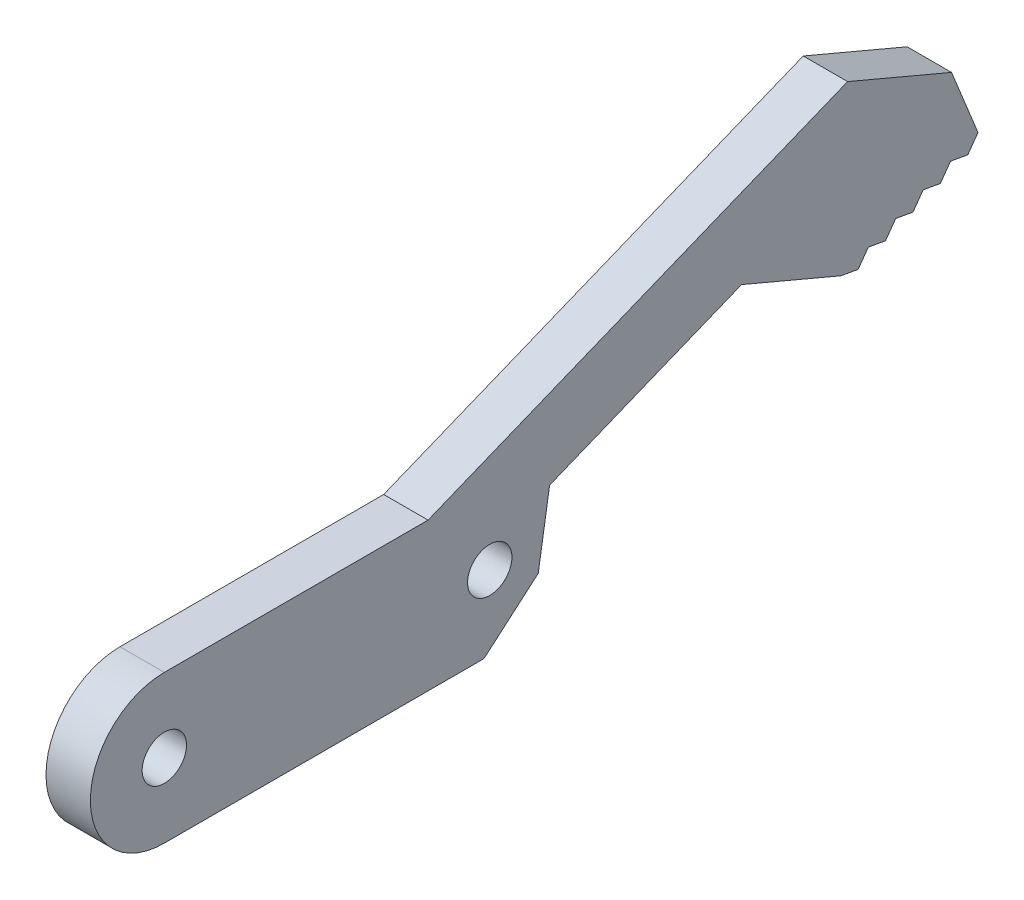
ISO-10303-21;
HEADER;
FILE_DESCRIPTION(('STEP AP214'),'2;1');
FILE_NAME('part.step','',(''),(''),'','','');
FILE_SCHEMA(('AUTOMOTIVE_DESIGN { 1 0 10303 214 1 1 1 1 }'));
ENDSEC;
DATA;
#1=APPLICATION_CONTEXT('core data for automotive mechanical design processes');
#2=APPLICATION_PROTOCOL_DEFINITION('international standard','automotive_design',2000,#1);
#3=PRODUCT_CONTEXT('',#1,'mechanical');
#4=PRODUCT('Part','Part','',(#3));
#5=PRODUCT_RELATED_PRODUCT_CATEGORY('part','',(#4));
#6=PRODUCT_DEFINITION_FORMATION('','',#4);
#7=PRODUCT_DEFINITION_CONTEXT('part definition',#1,'design');
#8=PRODUCT_DEFINITION('design','',#6,#7);
#9=PRODUCT_DEFINITION_SHAPE('','',#8);
#10=(LENGTH_UNIT() NAMED_UNIT(*) SI_UNIT(.MILLI.,.METRE.));
#11=(NAMED_UNIT(*) PLANE_ANGLE_UNIT() SI_UNIT($,.RADIAN.));
#12=(NAMED_UNIT(*) SI_UNIT($,.STERADIAN.) SOLID_ANGLE_UNIT());
#13=UNCERTAINTY_MEASURE_WITH_UNIT(LENGTH_MEASURE(1.E-05),#10,'distance_accuracy_value','');
#14=(GEOMETRIC_REPRESENTATION_CONTEXT(3) GLOBAL_UNCERTAINTY_ASSIGNED_CONTEXT((#13)) GLOBAL_UNIT_ASSIGNED_CONTEXT((#10,
#11,#12)) REPRESENTATION_CONTEXT('',''));
#15=CARTESIAN_POINT('',(0.,0.,0.));
#16=DIRECTION('',(0.,0.,1.));
#17=DIRECTION('',(1.,0.,0.));
#18=AXIS2_PLACEMENT_3D('',#15,#16,#17);
#19=CARTESIAN_POINT('',(1.5,0.,0.));
#20=DIRECTION('',(1.,0.,0.));
#21=DIRECTION('',(0.,0.,-1.));
#22=AXIS2_PLACEMENT_3D('',#19,#20,#21);
#23=PLANE('',#22);
#24=CARTESIAN_POINT('',(1.5,0.,-11.));
#25=DIRECTION('',(1.,0.,0.));
#26=DIRECTION('',(0.,0.,-1.));
#27=AXIS2_PLACEMENT_3D('',#24,#25,#26);
#28=CIRCLE('',#27,1.5);
#29=CARTESIAN_POINT('',(1.5,0.,-12.5));
#30=VERTEX_POINT('',#29);
#31=EDGE_CURVE('E134',#30,#30,#28,.T.);
#32=ORIENTED_EDGE('',*,*,#31,.F.);
#33=EDGE_LOOP('',(#32));
#34=FACE_BOUND('',#33,.T.);
#35=CARTESIAN_POINT('',(1.5,0.,11.));
#36=DIRECTION('',(1.,0.,0.));
#37=DIRECTION('',(0.,0.,-1.));
#38=AXIS2_PLACEMENT_3D('',#35,#36,#37);
#39=CIRCLE('',#38,1.5);
#40=CARTESIAN_POINT('',(1.5,0.,9.50000000000001));
#41=VERTEX_POINT('',#40);
#42=EDGE_CURVE('E105',#41,#41,#39,.T.);
#43=ORIENTED_EDGE('',*,*,#42,.F.);
#44=EDGE_LOOP('',(#43));
#45=FACE_BOUND('',#44,.T.);
#46=DIRECTION('',(0.,0.811746559900306,-0.584009865062243));
#47=VECTOR('',#46,1.);
#48=CARTESIAN_POINT('',(1.5,-17.1372740545539,-23.8200141676892));
#49=LINE('',#48,#47);
#50=CARTESIAN_POINT('',(1.5,7.39191676895877,-41.4675043211245));
#51=VERTEX_POINT('',#50);
#52=CARTESIAN_POINT('',(1.5,8.35132428291398,-42.1577486417576));
#53=VERTEX_POINT('',#52);
#54=EDGE_CURVE('E292',#51,#53,#49,.T.);
#55=ORIENTED_EDGE('',*,*,#54,.T.);
#56=DIRECTION('',(0.,-0.176310458660285,-0.984334608843456));
#57=VECTOR('',#56,1.);
#58=CARTESIAN_POINT('',(1.5,15.4081336773122,-2.7598492335221));
#59=LINE('',#58,#57);
#60=CARTESIAN_POINT('',(1.5,8.14294202768355,-43.3211388753874));
#61=VERTEX_POINT('',#60);
#62=EDGE_CURVE('E296',#53,#61,#59,.T.);
#63=ORIENTED_EDGE('',*,*,#62,.T.);
#64=DIRECTION('',(0.,0.811746559900309,-0.584009865062239));
#65=VECTOR('',#64,1.);
#66=CARTESIAN_POINT('',(1.5,-17.7598725540869,-24.6853971353918));
#67=LINE('',#66,#65);
#68=CARTESIAN_POINT('',(1.5,9.10234954163876,-44.0113831960205));
#69=VERTEX_POINT('',#68);
#70=EDGE_CURVE('E245',#61,#69,#67,.T.);
#71=ORIENTED_EDGE('',*,*,#70,.T.);
#72=DIRECTION('',(0.,0.926817277131445,0.375512629362388));
#73=VECTOR('',#72,1.);
#74=CARTESIAN_POINT('',(1.5,16.6008716845223,-40.9732549309526));
#75=LINE('',#74,#73);
#76=CARTESIAN_POINT('',(1.5,13.5184546570459,-42.2221381265287));
#77=VERTEX_POINT('',#76);
#78=EDGE_CURVE('E68',#69,#77,#75,.T.);
#79=ORIENTED_EDGE('',*,*,#78,.T.);
#80=DIRECTION('',(0.,-0.389831254937157,-0.920886308223834));
#81=VECTOR('',#80,1.);
#82=CARTESIAN_POINT('',(1.5,16.4926366310558,-35.1963201005385));
#83=LINE('',#82,#81);
#84=CARTESIAN_POINT('',(1.5,16.4926366310558,-35.1963201005385));
#85=VERTEX_POINT('',#84);
#86=EDGE_CURVE('E196',#85,#77,#83,.T.);
#87=ORIENTED_EDGE('',*,*,#86,.F.);
#88=DIRECTION('',(0.,0.375512629362387,-0.926817277131445));
#89=VECTOR('',#88,1.);
#90=CARTESIAN_POINT('',(1.5,1.91758297252369,0.776934830414033));
#91=LINE('',#90,#89);
#92=CARTESIAN_POINT('',(1.5,5.,-6.83089812380655));
#93=VERTEX_POINT('',#92);
#94=EDGE_CURVE('E179',#93,#85,#91,.T.);
#95=ORIENTED_EDGE('',*,*,#94,.F.);
#96=DIRECTION('',(0.,0.,-1.));
#97=VECTOR('',#96,1.);
#98=CARTESIAN_POINT('',(1.5,4.99999999999999,0.));
#99=LINE('',#98,#97);
#100=CARTESIAN_POINT('',(1.5,5.,11.));
#101=VERTEX_POINT('',#100);
#102=EDGE_CURVE('E120',#101,#93,#99,.T.);
#103=ORIENTED_EDGE('',*,*,#102,.F.);
#104=CARTESIAN_POINT('',(1.5,0.,11.));
#105=DIRECTION('',(1.,0.,0.));
#106=DIRECTION('',(0.,0.,-1.));
#107=AXIS2_PLACEMENT_3D('',#104,#105,#106);
#108=CIRCLE('',#107,5.);
#109=CARTESIAN_POINT('',(1.5,-5.,11.));
#110=VERTEX_POINT('',#109);
#111=EDGE_CURVE('E76',#101,#110,#108,.T.);
#112=ORIENTED_EDGE('',*,*,#111,.T.);
#113=DIRECTION('',(0.,0.,-1.));
#114=VECTOR('',#113,1.);
#115=CARTESIAN_POINT('',(1.5,-5.,0.));
#116=LINE('',#115,#114);
#117=CARTESIAN_POINT('',(1.5,-5.,-10.6103174919287));
#118=VERTEX_POINT('',#117);
#119=EDGE_CURVE('E104',#110,#118,#116,.T.);
#120=ORIENTED_EDGE('',*,*,#119,.T.);
#121=DIRECTION('',(0.,-0.652055247286905,0.758171454544164));
#122=VECTOR('',#121,1.);
#123=CARTESIAN_POINT('',(1.5,-8.11953898551642,-6.9831012092637));
#124=LINE('',#123,#122);
#125=CARTESIAN_POINT('',(1.5,-1.84405260313138,-14.2798673319224));
#126=VERTEX_POINT('',#125);
#127=EDGE_CURVE('E246',#126,#118,#124,.T.);
#128=ORIENTED_EDGE('',*,*,#127,.F.);
#129=DIRECTION('',(0.,-0.987317731643147,0.158756722008964));
#130=VECTOR('',#129,1.);
#131=CARTESIAN_POINT('',(1.5,-2.2847508524873,-14.209004825132));
#132=LINE('',#131,#130);
#133=CARTESIAN_POINT('',(1.5,2.93456521802145,-15.0482498664458));
#134=VERTEX_POINT('',#133);
#135=EDGE_CURVE('E250',#134,#126,#132,.T.);
#136=ORIENTED_EDGE('',*,*,#135,.F.);
#137=DIRECTION('',(0.,0.375512629362387,-0.926817277131445));
#138=VECTOR('',#137,1.);
#139=CARTESIAN_POINT('',(1.5,-2.71650341313353,-1.1006283163979));
#140=LINE('',#139,#138);
#141=CARTESIAN_POINT('',(1.5,8.19174202909487,-28.0236917462861));
#142=VERTEX_POINT('',#141);
#143=EDGE_CURVE('E154',#134,#142,#140,.T.);
#144=ORIENTED_EDGE('',*,*,#143,.T.);
#145=DIRECTION('',(0.,0.389831254937157,0.920886308223834));
#146=VECTOR('',#145,1.);
#147=CARTESIAN_POINT('',(1.5,17.0070885712925,-7.19947144546191));
#148=LINE('',#147,#146);
#149=CARTESIAN_POINT('',(1.5,5.34722324801487,-34.743210424706));
#150=VERTEX_POINT('',#149);
#151=EDGE_CURVE('E176',#150,#142,#148,.T.);
#152=ORIENTED_EDGE('',*,*,#151,.F.);
#153=DIRECTION('',(0.,-0.176310458660285,-0.984334608843456));
#154=VECTOR('',#153,1.);
#155=CARTESIAN_POINT('',(1.5,11.2106343735009,-2.00800832410744));
#156=LINE('',#155,#154);
#157=CARTESIAN_POINT('',(1.5,5.13884099278445,-35.9066006583358));
#158=VERTEX_POINT('',#157);
#159=EDGE_CURVE('E269',#150,#158,#156,.T.);
#160=ORIENTED_EDGE('',*,*,#159,.T.);
#161=DIRECTION('',(0.,0.811746559900309,-0.584009865062239));
#162=VECTOR('',#161,1.);
#163=CARTESIAN_POINT('',(1.5,-15.2694785559546,-21.223865264582));
#164=LINE('',#163,#162);
#165=CARTESIAN_POINT('',(1.5,6.09824850673965,-36.5968449789689));
#166=VERTEX_POINT('',#165);
#167=EDGE_CURVE('E230',#158,#166,#164,.T.);
#168=ORIENTED_EDGE('',*,*,#167,.T.);
#169=DIRECTION('',(0.,-0.176310458660285,-0.984334608843456));
#170=VECTOR('',#169,1.);
#171=CARTESIAN_POINT('',(1.5,12.2600091994537,-2.1959685514611));
#172=LINE('',#171,#170);
#173=CARTESIAN_POINT('',(1.5,5.88986625150922,-37.7602352125987));
#174=VERTEX_POINT('',#173);
#175=EDGE_CURVE('E208',#166,#174,#172,.T.);
#176=ORIENTED_EDGE('',*,*,#175,.T.);
#177=DIRECTION('',(0.,0.811746559900306,-0.584009865062243));
#178=VECTOR('',#177,1.);
#179=CARTESIAN_POINT('',(1.5,-15.8920770554877,-22.0892482322843));
#180=LINE('',#179,#178);
#181=CARTESIAN_POINT('',(1.5,6.84927376546443,-38.4504795332318));
#182=VERTEX_POINT('',#181);
#183=EDGE_CURVE('E270',#174,#182,#180,.T.);
#184=ORIENTED_EDGE('',*,*,#183,.T.);
#185=DIRECTION('',(0.,-0.176310458660286,-0.984334608843456));
#186=VECTOR('',#185,1.);
#187=CARTESIAN_POINT('',(1.5,13.3093840254066,-2.38392877881479));
#188=LINE('',#187,#186);
#189=CARTESIAN_POINT('',(1.5,6.640891510234,-39.6138697668616));
#190=VERTEX_POINT('',#189);
#191=EDGE_CURVE('E274',#182,#190,#188,.T.);
#192=ORIENTED_EDGE('',*,*,#191,.T.);
#193=DIRECTION('',(0.,0.811746559900306,-0.584009865062243));
#194=VECTOR('',#193,1.);
#195=CARTESIAN_POINT('',(1.5,-16.5146755550208,-22.9546311999867));
#196=LINE('',#195,#194);
#197=CARTESIAN_POINT('',(1.5,7.6002990241892,-40.3041140874947));
#198=VERTEX_POINT('',#197);
#199=EDGE_CURVE('E209',#190,#198,#196,.T.);
#200=ORIENTED_EDGE('',*,*,#199,.T.);
#201=DIRECTION('',(0.,-0.176310458660286,-0.984334608843456));
#202=VECTOR('',#201,1.);
#203=CARTESIAN_POINT('',(1.5,14.3587588513594,-2.57188900616846));
#204=LINE('',#203,#202);
#205=EDGE_CURVE('E213',#198,#51,#204,.T.);
#206=ORIENTED_EDGE('',*,*,#205,.T.);
#207=EDGE_LOOP('',(#55,#63,#71,#79,#87,#95,#103,#112,#120,#128,#136,#144,#152,#160,#168,#176,
#184,#192,#200,#206));
#208=FACE_BOUND('',#207,.T.);
#209=ADVANCED_FACE('F53',(#34,#45,#208),#23,.T.);
#210=CARTESIAN_POINT('',(-1.5,0.,0.));
#211=DIRECTION('',(1.,0.,0.));
#212=DIRECTION('',(0.,0.,-1.));
#213=AXIS2_PLACEMENT_3D('',#210,#211,#212);
#214=PLANE('',#213);
#215=CARTESIAN_POINT('',(-1.5,0.,-11.));
#216=DIRECTION('',(1.,0.,0.));
#217=DIRECTION('',(0.,0.,-1.));
#218=AXIS2_PLACEMENT_3D('',#215,#216,#217);
#219=CIRCLE('',#218,1.5);
#220=CARTESIAN_POINT('',(-1.5,0.,-12.5));
#221=VERTEX_POINT('',#220);
#222=EDGE_CURVE('E112',#221,#221,#219,.T.);
#223=ORIENTED_EDGE('',*,*,#222,.T.);
#224=EDGE_LOOP('',(#223));
#225=FACE_BOUND('',#224,.T.);
#226=CARTESIAN_POINT('',(-1.5,0.,11.));
#227=DIRECTION('',(1.,0.,0.));
#228=DIRECTION('',(0.,0.,-1.));
#229=AXIS2_PLACEMENT_3D('',#226,#227,#228);
#230=CIRCLE('',#229,1.5);
#231=CARTESIAN_POINT('',(-1.5,0.,9.50000000000001));
#232=VERTEX_POINT('',#231);
#233=EDGE_CURVE('E115',#232,#232,#230,.T.);
#234=ORIENTED_EDGE('',*,*,#233,.T.);
#235=EDGE_LOOP('',(#234));
#236=FACE_BOUND('',#235,.T.);
#237=DIRECTION('',(0.,-0.176310458660285,-0.984334608843456));
#238=VECTOR('',#237,1.);
#239=CARTESIAN_POINT('',(-1.5,15.4081336773122,-2.7598492335221));
#240=LINE('',#239,#238);
#241=CARTESIAN_POINT('',(-1.5,8.35132428291398,-42.1577486417576));
#242=VERTEX_POINT('',#241);
#243=CARTESIAN_POINT('',(-1.5,8.14294202768355,-43.3211388753874));
#244=VERTEX_POINT('',#243);
#245=EDGE_CURVE('E295',#242,#244,#240,.T.);
#246=ORIENTED_EDGE('',*,*,#245,.F.);
#247=DIRECTION('',(0.,0.811746559900306,-0.584009865062243));
#248=VECTOR('',#247,1.);
#249=CARTESIAN_POINT('',(-1.5,-17.1372740545539,-23.8200141676892));
#250=LINE('',#249,#248);
#251=CARTESIAN_POINT('',(-1.5,7.39191676895877,-41.4675043211245));
#252=VERTEX_POINT('',#251);
#253=EDGE_CURVE('E289',#252,#242,#250,.T.);
#254=ORIENTED_EDGE('',*,*,#253,.F.);
#255=DIRECTION('',(0.,-0.176310458660286,-0.984334608843456));
#256=VECTOR('',#255,1.);
#257=CARTESIAN_POINT('',(-1.5,14.3587588513594,-2.57188900616846));
#258=LINE('',#257,#256);
#259=CARTESIAN_POINT('',(-1.5,7.6002990241892,-40.3041140874947));
#260=VERTEX_POINT('',#259);
#261=EDGE_CURVE('E212',#260,#252,#258,.T.);
#262=ORIENTED_EDGE('',*,*,#261,.F.);
#263=DIRECTION('',(0.,0.811746559900306,-0.584009865062243));
#264=VECTOR('',#263,1.);
#265=CARTESIAN_POINT('',(-1.5,-16.5146755550208,-22.9546311999867));
#266=LINE('',#265,#264);
#267=CARTESIAN_POINT('',(-1.5,6.640891510234,-39.6138697668616));
#268=VERTEX_POINT('',#267);
#269=EDGE_CURVE('E205',#268,#260,#266,.T.);
#270=ORIENTED_EDGE('',*,*,#269,.F.);
#271=DIRECTION('',(0.,-0.176310458660286,-0.984334608843456));
#272=VECTOR('',#271,1.);
#273=CARTESIAN_POINT('',(-1.5,13.3093840254066,-2.38392877881479));
#274=LINE('',#273,#272);
#275=CARTESIAN_POINT('',(-1.5,6.84927376546443,-38.4504795332318));
#276=VERTEX_POINT('',#275);
#277=EDGE_CURVE('E273',#276,#268,#274,.T.);
#278=ORIENTED_EDGE('',*,*,#277,.F.);
#279=DIRECTION('',(0.,0.811746559900306,-0.584009865062243));
#280=VECTOR('',#279,1.);
#281=CARTESIAN_POINT('',(-1.5,-15.8920770554877,-22.0892482322843));
#282=LINE('',#281,#280);
#283=CARTESIAN_POINT('',(-1.5,5.88986625150922,-37.7602352125987));
#284=VERTEX_POINT('',#283);
#285=EDGE_CURVE('E266',#284,#276,#282,.T.);
#286=ORIENTED_EDGE('',*,*,#285,.F.);
#287=DIRECTION('',(0.,-0.176310458660285,-0.984334608843456));
#288=VECTOR('',#287,1.);
#289=CARTESIAN_POINT('',(-1.5,12.2600091994537,-2.1959685514611));
#290=LINE('',#289,#288);
#291=CARTESIAN_POINT('',(-1.5,6.09824850673965,-36.5968449789689));
#292=VERTEX_POINT('',#291);
#293=EDGE_CURVE('E233',#292,#284,#290,.T.);
#294=ORIENTED_EDGE('',*,*,#293,.F.);
#295=DIRECTION('',(0.,0.811746559900309,-0.584009865062239));
#296=VECTOR('',#295,1.);
#297=CARTESIAN_POINT('',(-1.5,-15.2694785559546,-21.223865264582));
#298=LINE('',#297,#296);
#299=CARTESIAN_POINT('',(-1.5,5.13884099278445,-35.9066006583358));
#300=VERTEX_POINT('',#299);
#301=EDGE_CURVE('E225',#300,#292,#298,.T.);
#302=ORIENTED_EDGE('',*,*,#301,.F.);
#303=DIRECTION('',(0.,-0.176310458660285,-0.984334608843456));
#304=VECTOR('',#303,1.);
#305=CARTESIAN_POINT('',(-1.5,11.2106343735009,-2.00800832410744));
#306=LINE('',#305,#304);
#307=CARTESIAN_POINT('',(-1.5,5.34722324801487,-34.743210424706));
#308=VERTEX_POINT('',#307);
#309=EDGE_CURVE('E253',#308,#300,#306,.T.);
#310=ORIENTED_EDGE('',*,*,#309,.F.);
#311=DIRECTION('',(0.,0.389831254937157,0.920886308223834));
#312=VECTOR('',#311,1.);
#313=CARTESIAN_POINT('',(-1.5,17.0070885712925,-7.19947144546191));
#314=LINE('',#313,#312);
#315=CARTESIAN_POINT('',(-1.5,8.19174202909487,-28.0236917462861));
#316=VERTEX_POINT('',#315);
#317=EDGE_CURVE('E183',#308,#316,#314,.T.);
#318=ORIENTED_EDGE('',*,*,#317,.T.);
#319=DIRECTION('',(0.,0.375512629362387,-0.926817277131445));
#320=VECTOR('',#319,1.);
#321=CARTESIAN_POINT('',(-1.5,-2.71650341313353,-1.1006283163979));
#322=LINE('',#321,#320);
#323=CARTESIAN_POINT('',(-1.5,2.93456521802145,-15.0482498664458));
#324=VERTEX_POINT('',#323);
#325=EDGE_CURVE('E162',#324,#316,#322,.T.);
#326=ORIENTED_EDGE('',*,*,#325,.F.);
#327=DIRECTION('',(0.,-0.987317731643147,0.158756722008964));
#328=VECTOR('',#327,1.);
#329=CARTESIAN_POINT('',(-1.5,-2.2847508524873,-14.209004825132));
#330=LINE('',#329,#328);
#331=CARTESIAN_POINT('',(-1.5,-1.84405260313138,-14.2798673319224));
#332=VERTEX_POINT('',#331);
#333=EDGE_CURVE('E249',#324,#332,#330,.T.);
#334=ORIENTED_EDGE('',*,*,#333,.T.);
#335=DIRECTION('',(0.,-0.652055247286905,0.758171454544164));
#336=VECTOR('',#335,1.);
#337=CARTESIAN_POINT('',(-1.5,-8.11953898551642,-6.9831012092637));
#338=LINE('',#337,#336);
#339=CARTESIAN_POINT('',(-1.5,-5.,-10.6103174919287));
#340=VERTEX_POINT('',#339);
#341=EDGE_CURVE('E111',#332,#340,#338,.T.);
#342=ORIENTED_EDGE('',*,*,#341,.T.);
#343=DIRECTION('',(0.,0.,-1.));
#344=VECTOR('',#343,1.);
#345=CARTESIAN_POINT('',(-1.5,-5.,0.));
#346=LINE('',#345,#344);
#347=CARTESIAN_POINT('',(-1.5,-5.,11.));
#348=VERTEX_POINT('',#347);
#349=EDGE_CURVE('E96',#348,#340,#346,.T.);
#350=ORIENTED_EDGE('',*,*,#349,.F.);
#351=CARTESIAN_POINT('',(-1.5,0.,11.));
#352=DIRECTION('',(1.,0.,0.));
#353=DIRECTION('',(0.,0.,-1.));
#354=AXIS2_PLACEMENT_3D('',#351,#352,#353);
#355=CIRCLE('',#354,5.);
#356=CARTESIAN_POINT('',(-1.5,5.,11.));
#357=VERTEX_POINT('',#356);
#358=EDGE_CURVE('E88',#357,#348,#355,.T.);
#359=ORIENTED_EDGE('',*,*,#358,.F.);
#360=DIRECTION('',(0.,0.,-1.));
#361=VECTOR('',#360,1.);
#362=CARTESIAN_POINT('',(-1.5,4.99999999999999,0.));
#363=LINE('',#362,#361);
#364=CARTESIAN_POINT('',(-1.5,5.,-6.83089812380655));
#365=VERTEX_POINT('',#364);
#366=EDGE_CURVE('E97',#357,#365,#363,.T.);
#367=ORIENTED_EDGE('',*,*,#366,.T.);
#368=DIRECTION('',(0.,0.375512629362387,-0.926817277131445));
#369=VECTOR('',#368,1.);
#370=CARTESIAN_POINT('',(-1.5,1.91758297252369,0.776934830414033));
#371=LINE('',#370,#369);
#372=CARTESIAN_POINT('',(-1.5,16.4926366310558,-35.1963201005385));
#373=VERTEX_POINT('',#372);
#374=EDGE_CURVE('E168',#365,#373,#371,.T.);
#375=ORIENTED_EDGE('',*,*,#374,.T.);
#376=DIRECTION('',(0.,-0.389831254937157,-0.920886308223834));
#377=VECTOR('',#376,1.);
#378=CARTESIAN_POINT('',(-1.5,16.4926366310558,-35.1963201005385));
#379=LINE('',#378,#377);
#380=CARTESIAN_POINT('',(-1.5,13.5184546570459,-42.2221381265287));
#381=VERTEX_POINT('',#380);
#382=EDGE_CURVE('E193',#373,#381,#379,.T.);
#383=ORIENTED_EDGE('',*,*,#382,.T.);
#384=DIRECTION('',(0.,0.926817277131445,0.375512629362388));
#385=VECTOR('',#384,1.);
#386=CARTESIAN_POINT('',(-1.5,16.6008716845223,-40.9732549309526));
#387=LINE('',#386,#385);
#388=CARTESIAN_POINT('',(-1.5,9.10234954163876,-44.0113831960205));
#389=VERTEX_POINT('',#388);
#390=EDGE_CURVE('E172',#389,#381,#387,.T.);
#391=ORIENTED_EDGE('',*,*,#390,.F.);
#392=DIRECTION('',(0.,0.811746559900309,-0.584009865062239));
#393=VECTOR('',#392,1.);
#394=CARTESIAN_POINT('',(-1.5,-17.7598725540869,-24.6853971353918));
#395=LINE('',#394,#393);
#396=EDGE_CURVE('E258',#244,#389,#395,.T.);
#397=ORIENTED_EDGE('',*,*,#396,.F.);
#398=EDGE_LOOP('',(#246,#254,#262,#270,#278,#286,#294,#302,#310,#318,#326,#334,#342,#350,#359,
#367,#375,#383,#391,#397));
#399=FACE_BOUND('',#398,.T.);
#400=ADVANCED_FACE('F108',(#225,#236,#399),#214,.F.);
#401=CARTESIAN_POINT('',(-1.5,16.6008716845223,-40.9732549309526));
#402=DIRECTION('',(0.,0.375512629362387,-0.926817277131445));
#403=DIRECTION('',(0.,0.926817277131445,0.375512629362388));
#404=AXIS2_PLACEMENT_3D('',#401,#402,#403);
#405=PLANE('',#404);
#406=ORIENTED_EDGE('',*,*,#78,.F.);
#407=DIRECTION('',(1.,0.,0.));
#408=VECTOR('',#407,1.);
#409=CARTESIAN_POINT('',(-1.5,9.10234954163876,-44.0113831960205));
#410=LINE('',#409,#408);
#411=EDGE_CURVE('E216',#389,#69,#410,.T.);
#412=ORIENTED_EDGE('',*,*,#411,.F.);
#413=ORIENTED_EDGE('',*,*,#390,.T.);
#414=DIRECTION('',(1.,0.,0.));
#415=VECTOR('',#414,1.);
#416=CARTESIAN_POINT('',(-1.5,13.5184546570459,-42.2221381265287));
#417=LINE('',#416,#415);
#418=EDGE_CURVE('E178',#381,#77,#417,.T.);
#419=ORIENTED_EDGE('',*,*,#418,.T.);
#420=EDGE_LOOP('',(#406,#412,#413,#419));
#421=FACE_BOUND('',#420,.T.);
#422=ADVANCED_FACE('F326',(#421),#405,.T.);
#423=CARTESIAN_POINT('',(1.5,4.99999999999999,0.));
#424=DIRECTION('',(0.,1.,0.));
#425=DIRECTION('',(0.,0.,1.));
#426=AXIS2_PLACEMENT_3D('',#423,#424,#425);
#427=PLANE('',#426);
#428=ORIENTED_EDGE('',*,*,#102,.T.);
#429=DIRECTION('',(1.,0.,0.));
#430=VECTOR('',#429,1.);
#431=CARTESIAN_POINT('',(-1.5,5.,-6.83089812380655));
#432=LINE('',#431,#430);
#433=EDGE_CURVE('E151',#365,#93,#432,.T.);
#434=ORIENTED_EDGE('',*,*,#433,.F.);
#435=ORIENTED_EDGE('',*,*,#366,.F.);
#436=DIRECTION('',(-1.,0.,0.));
#437=VECTOR('',#436,1.);
#438=CARTESIAN_POINT('',(1.5,5.,11.));
#439=LINE('',#438,#437);
#440=EDGE_CURVE('E12',#101,#357,#439,.T.);
#441=ORIENTED_EDGE('',*,*,#440,.F.);
#442=EDGE_LOOP('',(#428,#434,#435,#441));
#443=FACE_BOUND('',#442,.T.);
#444=ADVANCED_FACE('F55',(#443),#427,.T.);
#445=CARTESIAN_POINT('',(1.5,0.,11.));
#446=DIRECTION('',(-1.,0.,0.));
#447=DIRECTION('',(0.,0.,1.));
#448=AXIS2_PLACEMENT_3D('',#445,#446,#447);
#449=CYLINDRICAL_SURFACE('',#448,5.);
#450=ORIENTED_EDGE('',*,*,#358,.T.);
#451=DIRECTION('',(-1.,0.,0.));
#452=VECTOR('',#451,1.);
#453=CARTESIAN_POINT('',(1.5,-5.,11.));
#454=LINE('',#453,#452);
#455=EDGE_CURVE('E61',#110,#348,#454,.T.);
#456=ORIENTED_EDGE('',*,*,#455,.F.);
#457=ORIENTED_EDGE('',*,*,#111,.F.);
#458=ORIENTED_EDGE('',*,*,#440,.T.);
#459=EDGE_LOOP('',(#450,#456,#457,#458));
#460=FACE_BOUND('',#459,.T.);
#461=ADVANCED_FACE('F90',(#460),#449,.T.);
#462=CARTESIAN_POINT('',(1.5,-5.,0.));
#463=DIRECTION('',(0.,1.,0.));
#464=DIRECTION('',(0.,0.,1.));
#465=AXIS2_PLACEMENT_3D('',#462,#463,#464);
#466=PLANE('',#465);
#467=ORIENTED_EDGE('',*,*,#349,.T.);
#468=DIRECTION('',(1.,0.,0.));
#469=VECTOR('',#468,1.);
#470=CARTESIAN_POINT('',(-1.5,-5.,-10.6103174919287));
#471=LINE('',#470,#469);
#472=EDGE_CURVE('E243',#340,#118,#471,.T.);
#473=ORIENTED_EDGE('',*,*,#472,.T.);
#474=ORIENTED_EDGE('',*,*,#119,.F.);
#475=ORIENTED_EDGE('',*,*,#455,.T.);
#476=EDGE_LOOP('',(#467,#473,#474,#475));
#477=FACE_BOUND('',#476,.T.);
#478=ADVANCED_FACE('F101',(#477),#466,.F.);
#479=CARTESIAN_POINT('',(1.5,0.,-11.));
#480=DIRECTION('',(-1.,0.,0.));
#481=DIRECTION('',(0.,0.,1.));
#482=AXIS2_PLACEMENT_3D('',#479,#480,#481);
#483=CYLINDRICAL_SURFACE('',#482,1.5);
#484=ORIENTED_EDGE('',*,*,#31,.T.);
#485=EDGE_LOOP('',(#484));
#486=FACE_BOUND('',#485,.T.);
#487=ORIENTED_EDGE('',*,*,#222,.F.);
#488=EDGE_LOOP('',(#487));
#489=FACE_BOUND('',#488,.T.);
#490=ADVANCED_FACE('F446',(#486,#489),#483,.F.);
#491=CARTESIAN_POINT('',(1.5,0.,11.));
#492=DIRECTION('',(-1.,0.,0.));
#493=DIRECTION('',(0.,0.,1.));
#494=AXIS2_PLACEMENT_3D('',#491,#492,#493);
#495=CYLINDRICAL_SURFACE('',#494,1.5);
#496=ORIENTED_EDGE('',*,*,#42,.T.);
#497=EDGE_LOOP('',(#496));
#498=FACE_BOUND('',#497,.T.);
#499=ORIENTED_EDGE('',*,*,#233,.F.);
#500=EDGE_LOOP('',(#499));
#501=FACE_BOUND('',#500,.T.);
#502=ADVANCED_FACE('F443',(#498,#501),#495,.F.);
#503=CARTESIAN_POINT('',(-1.5,17.0070885712925,-7.19947144546191));
#504=DIRECTION('',(0.,0.920886308223834,-0.389831254937157));
#505=DIRECTION('',(0.,0.389831254937157,0.920886308223834));
#506=AXIS2_PLACEMENT_3D('',#503,#504,#505);
#507=PLANE('',#506);
#508=ORIENTED_EDGE('',*,*,#151,.T.);
#509=DIRECTION('',(1.,0.,0.));
#510=VECTOR('',#509,1.);
#511=CARTESIAN_POINT('',(-1.5,8.19174202909487,-28.0236917462861));
#512=LINE('',#511,#510);
#513=EDGE_CURVE('E138',#316,#142,#512,.T.);
#514=ORIENTED_EDGE('',*,*,#513,.F.);
#515=ORIENTED_EDGE('',*,*,#317,.F.);
#516=DIRECTION('',(1.,0.,0.));
#517=VECTOR('',#516,1.);
#518=CARTESIAN_POINT('',(-1.5,5.34722324801487,-34.743210424706));
#519=LINE('',#518,#517);
#520=EDGE_CURVE('E130',#308,#150,#519,.T.);
#521=ORIENTED_EDGE('',*,*,#520,.T.);
#522=EDGE_LOOP('',(#508,#514,#515,#521));
#523=FACE_BOUND('',#522,.T.);
#524=ADVANCED_FACE('F419',(#523),#507,.F.);
#525=CARTESIAN_POINT('',(-1.5,-2.71650341313353,-1.1006283163979));
#526=DIRECTION('',(0.,-0.926817277131445,-0.375512629362387));
#527=DIRECTION('',(0.,0.375512629362387,-0.926817277131445));
#528=AXIS2_PLACEMENT_3D('',#525,#526,#527);
#529=PLANE('',#528);
#530=ORIENTED_EDGE('',*,*,#143,.F.);
#531=DIRECTION('',(1.,0.,0.));
#532=VECTOR('',#531,1.);
#533=CARTESIAN_POINT('',(-1.5,2.93456521802145,-15.0482498664458));
#534=LINE('',#533,#532);
#535=EDGE_CURVE('E142',#324,#134,#534,.T.);
#536=ORIENTED_EDGE('',*,*,#535,.F.);
#537=ORIENTED_EDGE('',*,*,#325,.T.);
#538=ORIENTED_EDGE('',*,*,#513,.T.);
#539=EDGE_LOOP('',(#530,#536,#537,#538));
#540=FACE_BOUND('',#539,.T.);
#541=ADVANCED_FACE('F347',(#540),#529,.T.);
#542=CARTESIAN_POINT('',(-1.5,1.91758297252369,0.776934830414033));
#543=DIRECTION('',(0.,-0.926817277131445,-0.375512629362387));
#544=DIRECTION('',(0.,0.375512629362387,-0.926817277131445));
#545=AXIS2_PLACEMENT_3D('',#542,#543,#544);
#546=PLANE('',#545);
#547=ORIENTED_EDGE('',*,*,#94,.T.);
#548=DIRECTION('',(1.,0.,0.));
#549=VECTOR('',#548,1.);
#550=CARTESIAN_POINT('',(-1.5,16.4926366310558,-35.1963201005385));
#551=LINE('',#550,#549);
#552=EDGE_CURVE('E190',#373,#85,#551,.T.);
#553=ORIENTED_EDGE('',*,*,#552,.F.);
#554=ORIENTED_EDGE('',*,*,#374,.F.);
#555=ORIENTED_EDGE('',*,*,#433,.T.);
#556=EDGE_LOOP('',(#547,#553,#554,#555));
#557=FACE_BOUND('',#556,.T.);
#558=ADVANCED_FACE('F462',(#557),#546,.F.);
#559=CARTESIAN_POINT('',(-1.5,16.4926366310558,-35.1963201005385));
#560=DIRECTION('',(0.,-0.920886308223833,0.389831254937157));
#561=DIRECTION('',(0.,-0.389831254937157,-0.920886308223834));
#562=AXIS2_PLACEMENT_3D('',#559,#560,#561);
#563=PLANE('',#562);
#564=ORIENTED_EDGE('',*,*,#86,.T.);
#565=ORIENTED_EDGE('',*,*,#418,.F.);
#566=ORIENTED_EDGE('',*,*,#382,.F.);
#567=ORIENTED_EDGE('',*,*,#552,.T.);
#568=EDGE_LOOP('',(#564,#565,#566,#567));
#569=FACE_BOUND('',#568,.T.);
#570=ADVANCED_FACE('F330',(#569),#563,.F.);
#571=CARTESIAN_POINT('',(-1.5,12.2600091994537,-2.1959685514611));
#572=DIRECTION('',(0.,-0.984334608843456,0.176310458660285));
#573=DIRECTION('',(0.,-0.176310458660285,-0.984334608843456));
#574=AXIS2_PLACEMENT_3D('',#571,#572,#573);
#575=PLANE('',#574);
#576=ORIENTED_EDGE('',*,*,#175,.F.);
#577=DIRECTION('',(1.,0.,0.));
#578=VECTOR('',#577,1.);
#579=CARTESIAN_POINT('',(-1.5,6.09824850673965,-36.5968449789689));
#580=LINE('',#579,#578);
#581=EDGE_CURVE('E221',#292,#166,#580,.T.);
#582=ORIENTED_EDGE('',*,*,#581,.F.);
#583=ORIENTED_EDGE('',*,*,#293,.T.);
#584=DIRECTION('',(1.,0.,0.));
#585=VECTOR('',#584,1.);
#586=CARTESIAN_POINT('',(-1.5,5.88986625150922,-37.7602352125987));
#587=LINE('',#586,#585);
#588=EDGE_CURVE('E198',#284,#174,#587,.T.);
#589=ORIENTED_EDGE('',*,*,#588,.T.);
#590=EDGE_LOOP('',(#576,#582,#583,#589));
#591=FACE_BOUND('',#590,.T.);
#592=ADVANCED_FACE('F414',(#591),#575,.T.);
#593=CARTESIAN_POINT('',(-1.5,-15.2694785559546,-21.223865264582));
#594=DIRECTION('',(0.,-0.584009865062239,-0.811746559900309));
#595=DIRECTION('',(0.,0.811746559900309,-0.584009865062239));
#596=AXIS2_PLACEMENT_3D('',#593,#594,#595);
#597=PLANE('',#596);
#598=ORIENTED_EDGE('',*,*,#167,.F.);
#599=DIRECTION('',(1.,0.,0.));
#600=VECTOR('',#599,1.);
#601=CARTESIAN_POINT('',(-1.5,5.13884099278445,-35.9066006583358));
#602=LINE('',#601,#600);
#603=EDGE_CURVE('E224',#300,#158,#602,.T.);
#604=ORIENTED_EDGE('',*,*,#603,.F.);
#605=ORIENTED_EDGE('',*,*,#301,.T.);
#606=ORIENTED_EDGE('',*,*,#581,.T.);
#607=EDGE_LOOP('',(#598,#604,#605,#606));
#608=FACE_BOUND('',#607,.T.);
#609=ADVANCED_FACE('F417',(#608),#597,.T.);
#610=CARTESIAN_POINT('',(-1.5,14.3587588513594,-2.57188900616846));
#611=DIRECTION('',(0.,-0.984334608843456,0.176310458660286));
#612=DIRECTION('',(0.,-0.176310458660286,-0.984334608843456));
#613=AXIS2_PLACEMENT_3D('',#610,#611,#612);
#614=PLANE('',#613);
#615=ORIENTED_EDGE('',*,*,#205,.F.);
#616=DIRECTION('',(1.,0.,0.));
#617=VECTOR('',#616,1.);
#618=CARTESIAN_POINT('',(-1.5,7.6002990241892,-40.3041140874947));
#619=LINE('',#618,#617);
#620=EDGE_CURVE('E201',#260,#198,#619,.T.);
#621=ORIENTED_EDGE('',*,*,#620,.F.);
#622=ORIENTED_EDGE('',*,*,#261,.T.);
#623=DIRECTION('',(1.,0.,0.));
#624=VECTOR('',#623,1.);
#625=CARTESIAN_POINT('',(-1.5,7.39191676895877,-41.4675043211245));
#626=LINE('',#625,#624);
#627=EDGE_CURVE('E204',#252,#51,#626,.T.);
#628=ORIENTED_EDGE('',*,*,#627,.T.);
#629=EDGE_LOOP('',(#615,#621,#622,#628));
#630=FACE_BOUND('',#629,.T.);
#631=ADVANCED_FACE('F372',(#630),#614,.T.);
#632=CARTESIAN_POINT('',(-1.5,-16.5146755550208,-22.9546311999867));
#633=DIRECTION('',(0.,-0.584009865062243,-0.811746559900306));
#634=DIRECTION('',(0.,0.811746559900306,-0.584009865062243));
#635=AXIS2_PLACEMENT_3D('',#632,#633,#634);
#636=PLANE('',#635);
#637=ORIENTED_EDGE('',*,*,#199,.F.);
#638=DIRECTION('',(1.,0.,0.));
#639=VECTOR('',#638,1.);
#640=CARTESIAN_POINT('',(-1.5,6.640891510234,-39.6138697668616));
#641=LINE('',#640,#639);
#642=EDGE_CURVE('E265',#268,#190,#641,.T.);
#643=ORIENTED_EDGE('',*,*,#642,.F.);
#644=ORIENTED_EDGE('',*,*,#269,.T.);
#645=ORIENTED_EDGE('',*,*,#620,.T.);
#646=EDGE_LOOP('',(#637,#643,#644,#645));
#647=FACE_BOUND('',#646,.T.);
#648=ADVANCED_FACE('F366',(#647),#636,.T.);
#649=CARTESIAN_POINT('',(-1.5,-17.7598725540869,-24.6853971353918));
#650=DIRECTION('',(0.,-0.584009865062239,-0.811746559900309));
#651=DIRECTION('',(0.,0.811746559900309,-0.584009865062239));
#652=AXIS2_PLACEMENT_3D('',#649,#650,#651);
#653=PLANE('',#652);
#654=ORIENTED_EDGE('',*,*,#70,.F.);
#655=DIRECTION('',(1.,0.,0.));
#656=VECTOR('',#655,1.);
#657=CARTESIAN_POINT('',(-1.5,8.14294202768355,-43.3211388753874));
#658=LINE('',#657,#656);
#659=EDGE_CURVE('E277',#244,#61,#658,.T.);
#660=ORIENTED_EDGE('',*,*,#659,.F.);
#661=ORIENTED_EDGE('',*,*,#396,.T.);
#662=ORIENTED_EDGE('',*,*,#411,.T.);
#663=EDGE_LOOP('',(#654,#660,#661,#662));
#664=FACE_BOUND('',#663,.T.);
#665=ADVANCED_FACE('F317',(#664),#653,.T.);
#666=CARTESIAN_POINT('',(-1.5,-2.2847508524873,-14.209004825132));
#667=DIRECTION('',(0.,0.158756722008964,0.987317731643147));
#668=DIRECTION('',(0.,-0.987317731643147,0.158756722008964));
#669=AXIS2_PLACEMENT_3D('',#666,#667,#668);
#670=PLANE('',#669);
#671=ORIENTED_EDGE('',*,*,#135,.T.);
#672=DIRECTION('',(1.,0.,0.));
#673=VECTOR('',#672,1.);
#674=CARTESIAN_POINT('',(-1.5,-1.84405260313138,-14.2798673319224));
#675=LINE('',#674,#673);
#676=EDGE_CURVE('E240',#332,#126,#675,.T.);
#677=ORIENTED_EDGE('',*,*,#676,.F.);
#678=ORIENTED_EDGE('',*,*,#333,.F.);
#679=ORIENTED_EDGE('',*,*,#535,.T.);
#680=EDGE_LOOP('',(#671,#677,#678,#679));
#681=FACE_BOUND('',#680,.T.);
#682=ADVANCED_FACE('F344',(#681),#670,.F.);
#683=CARTESIAN_POINT('',(-1.5,-8.11953898551642,-6.9831012092637));
#684=DIRECTION('',(0.,0.758171454544164,0.652055247286905));
#685=DIRECTION('',(0.,-0.652055247286905,0.758171454544164));
#686=AXIS2_PLACEMENT_3D('',#683,#684,#685);
#687=PLANE('',#686);
#688=ORIENTED_EDGE('',*,*,#127,.T.);
#689=ORIENTED_EDGE('',*,*,#472,.F.);
#690=ORIENTED_EDGE('',*,*,#341,.F.);
#691=ORIENTED_EDGE('',*,*,#676,.T.);
#692=EDGE_LOOP('',(#688,#689,#690,#691));
#693=FACE_BOUND('',#692,.T.);
#694=ADVANCED_FACE('F479',(#693),#687,.F.);
#695=CARTESIAN_POINT('',(-1.5,13.3093840254066,-2.38392877881479));
#696=DIRECTION('',(0.,-0.984334608843456,0.176310458660286));
#697=DIRECTION('',(0.,-0.176310458660286,-0.984334608843456));
#698=AXIS2_PLACEMENT_3D('',#695,#696,#697);
#699=PLANE('',#698);
#700=ORIENTED_EDGE('',*,*,#191,.F.);
#701=DIRECTION('',(1.,0.,0.));
#702=VECTOR('',#701,1.);
#703=CARTESIAN_POINT('',(-1.5,6.84927376546443,-38.4504795332318));
#704=LINE('',#703,#702);
#705=EDGE_CURVE('E262',#276,#182,#704,.T.);
#706=ORIENTED_EDGE('',*,*,#705,.F.);
#707=ORIENTED_EDGE('',*,*,#277,.T.);
#708=ORIENTED_EDGE('',*,*,#642,.T.);
#709=EDGE_LOOP('',(#700,#706,#707,#708));
#710=FACE_BOUND('',#709,.T.);
#711=ADVANCED_FACE('F383',(#710),#699,.T.);
#712=CARTESIAN_POINT('',(-1.5,-15.8920770554877,-22.0892482322843));
#713=DIRECTION('',(0.,-0.584009865062243,-0.811746559900306));
#714=DIRECTION('',(0.,0.811746559900306,-0.584009865062243));
#715=AXIS2_PLACEMENT_3D('',#712,#713,#714);
#716=PLANE('',#715);
#717=ORIENTED_EDGE('',*,*,#183,.F.);
#718=ORIENTED_EDGE('',*,*,#588,.F.);
#719=ORIENTED_EDGE('',*,*,#285,.T.);
#720=ORIENTED_EDGE('',*,*,#705,.T.);
#721=EDGE_LOOP('',(#717,#718,#719,#720));
#722=FACE_BOUND('',#721,.T.);
#723=ADVANCED_FACE('F408',(#722),#716,.T.);
#724=CARTESIAN_POINT('',(-1.5,11.2106343735009,-2.00800832410744));
#725=DIRECTION('',(0.,-0.984334608843456,0.176310458660285));
#726=DIRECTION('',(0.,-0.176310458660285,-0.984334608843456));
#727=AXIS2_PLACEMENT_3D('',#724,#725,#726);
#728=PLANE('',#727);
#729=ORIENTED_EDGE('',*,*,#159,.F.);
#730=ORIENTED_EDGE('',*,*,#520,.F.);
#731=ORIENTED_EDGE('',*,*,#309,.T.);
#732=ORIENTED_EDGE('',*,*,#603,.T.);
#733=EDGE_LOOP('',(#729,#730,#731,#732));
#734=FACE_BOUND('',#733,.T.);
#735=ADVANCED_FACE('F420',(#734),#728,.T.);
#736=CARTESIAN_POINT('',(-1.5,15.4081336773122,-2.7598492335221));
#737=DIRECTION('',(0.,-0.984334608843456,0.176310458660285));
#738=DIRECTION('',(0.,-0.176310458660285,-0.984334608843456));
#739=AXIS2_PLACEMENT_3D('',#736,#737,#738);
#740=PLANE('',#739);
#741=ORIENTED_EDGE('',*,*,#62,.F.);
#742=DIRECTION('',(1.,0.,0.));
#743=VECTOR('',#742,1.);
#744=CARTESIAN_POINT('',(-1.5,8.35132428291398,-42.1577486417576));
#745=LINE('',#744,#743);
#746=EDGE_CURVE('E286',#242,#53,#745,.T.);
#747=ORIENTED_EDGE('',*,*,#746,.F.);
#748=ORIENTED_EDGE('',*,*,#245,.T.);
#749=ORIENTED_EDGE('',*,*,#659,.T.);
#750=EDGE_LOOP('',(#741,#747,#748,#749));
#751=FACE_BOUND('',#750,.T.);
#752=ADVANCED_FACE('F307',(#751),#740,.T.);
#753=CARTESIAN_POINT('',(-1.5,-17.1372740545539,-23.8200141676892));
#754=DIRECTION('',(0.,-0.584009865062243,-0.811746559900306));
#755=DIRECTION('',(0.,0.811746559900306,-0.584009865062243));
#756=AXIS2_PLACEMENT_3D('',#753,#754,#755);
#757=PLANE('',#756);
#758=ORIENTED_EDGE('',*,*,#54,.F.);
#759=ORIENTED_EDGE('',*,*,#627,.F.);
#760=ORIENTED_EDGE('',*,*,#253,.T.);
#761=ORIENTED_EDGE('',*,*,#746,.T.);
#762=EDGE_LOOP('',(#758,#759,#760,#761));
#763=FACE_BOUND('',#762,.T.);
#764=ADVANCED_FACE('F427',(#763),#757,.T.);
#765=CLOSED_SHELL('',(#209,#400,#422,#444,#461,#478,#490,#502,#524,#541,#558,#570,#592,#609,
#631,#648,#665,#682,#694,#711,#723,#735,#752,#764));
#766=MANIFOLD_SOLID_BREP('B2',#765);
#767=ADVANCED_BREP_SHAPE_REPRESENTATION('',(#18,#766),#14);
#768=SHAPE_DEFINITION_REPRESENTATION(#9,#767);
ENDSEC;
END-ISO-10303-21;
